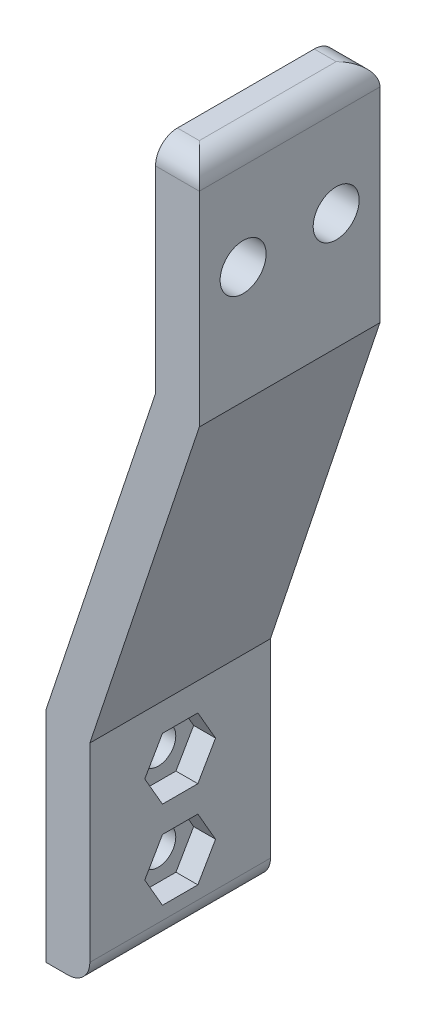
ISO-10303-21;
HEADER;
FILE_DESCRIPTION(('STEP AP214'),'2;1');
FILE_NAME('part.step','',(''),(''),'','','');
FILE_SCHEMA(('AUTOMOTIVE_DESIGN { 1 0 10303 214 1 1 1 1 }'));
ENDSEC;
DATA;
#1=APPLICATION_CONTEXT('core data for automotive mechanical design processes');
#2=APPLICATION_PROTOCOL_DEFINITION('international standard','automotive_design',2000,#1);
#3=PRODUCT_CONTEXT('',#1,'mechanical');
#4=PRODUCT('Part','Part','',(#3));
#5=PRODUCT_RELATED_PRODUCT_CATEGORY('part','',(#4));
#6=PRODUCT_DEFINITION_FORMATION('','',#4);
#7=PRODUCT_DEFINITION_CONTEXT('part definition',#1,'design');
#8=PRODUCT_DEFINITION('design','',#6,#7);
#9=PRODUCT_DEFINITION_SHAPE('','',#8);
#10=(LENGTH_UNIT() NAMED_UNIT(*) SI_UNIT(.MILLI.,.METRE.));
#11=(NAMED_UNIT(*) PLANE_ANGLE_UNIT() SI_UNIT($,.RADIAN.));
#12=(NAMED_UNIT(*) SI_UNIT($,.STERADIAN.) SOLID_ANGLE_UNIT());
#13=UNCERTAINTY_MEASURE_WITH_UNIT(LENGTH_MEASURE(1.E-05),#10,'distance_accuracy_value','');
#14=(GEOMETRIC_REPRESENTATION_CONTEXT(3) GLOBAL_UNCERTAINTY_ASSIGNED_CONTEXT((#13)) GLOBAL_UNIT_ASSIGNED_CONTEXT((#10,
#11,#12)) REPRESENTATION_CONTEXT('',''));
#15=CARTESIAN_POINT('',(0.,0.,0.));
#16=DIRECTION('',(0.,0.,1.));
#17=DIRECTION('',(1.,0.,0.));
#18=AXIS2_PLACEMENT_3D('',#15,#16,#17);
#19=CARTESIAN_POINT('',(-0.001000000000001,6.,8.25));
#20=DIRECTION('',(1.,0.,0.));
#21=DIRECTION('',(0.,1.,0.));
#22=AXIS2_PLACEMENT_3D('',#19,#20,#21);
#23=CYLINDRICAL_SURFACE('',#22,1.6);
#24=CARTESIAN_POINT('',(0.,6.,8.25));
#25=DIRECTION('',(1.,0.,0.));
#26=DIRECTION('',(0.,0.,-1.));
#27=AXIS2_PLACEMENT_3D('',#24,#25,#26);
#28=CIRCLE('',#27,1.6);
#29=CARTESIAN_POINT('',(0.,6.,6.65));
#30=VERTEX_POINT('',#29);
#31=EDGE_CURVE('E292',#30,#30,#28,.F.);
#32=ORIENTED_EDGE('',*,*,#31,.T.);
#33=EDGE_LOOP('',(#32));
#34=FACE_BOUND('',#33,.T.);
#35=CARTESIAN_POINT('',(2.,6.,8.25));
#36=DIRECTION('',(1.,0.,0.));
#37=DIRECTION('',(0.,0.,-1.));
#38=AXIS2_PLACEMENT_3D('',#35,#36,#37);
#39=CIRCLE('',#38,1.6);
#40=CARTESIAN_POINT('',(2.,6.,6.65));
#41=VERTEX_POINT('',#40);
#42=EDGE_CURVE('E37',#41,#41,#39,.F.);
#43=ORIENTED_EDGE('',*,*,#42,.F.);
#44=EDGE_LOOP('',(#43));
#45=FACE_BOUND('',#44,.T.);
#46=ADVANCED_FACE('F33',(#34,#45),#23,.F.);
#47=CARTESIAN_POINT('',(-0.00100000000000187,14.,8.25));
#48=DIRECTION('',(1.,0.,0.));
#49=DIRECTION('',(0.,1.,0.));
#50=AXIS2_PLACEMENT_3D('',#47,#48,#49);
#51=CYLINDRICAL_SURFACE('',#50,1.6);
#52=CARTESIAN_POINT('',(0.,14.,8.25));
#53=DIRECTION('',(1.,0.,0.));
#54=DIRECTION('',(0.,0.,-1.));
#55=AXIS2_PLACEMENT_3D('',#52,#53,#54);
#56=CIRCLE('',#55,1.6);
#57=CARTESIAN_POINT('',(0.,14.,6.65));
#58=VERTEX_POINT('',#57);
#59=EDGE_CURVE('E295',#58,#58,#56,.F.);
#60=ORIENTED_EDGE('',*,*,#59,.T.);
#61=EDGE_LOOP('',(#60));
#62=FACE_BOUND('',#61,.T.);
#63=CARTESIAN_POINT('',(2.,14.,8.25));
#64=DIRECTION('',(1.,0.,0.));
#65=DIRECTION('',(0.,0.,-1.));
#66=AXIS2_PLACEMENT_3D('',#63,#64,#65);
#67=CIRCLE('',#66,1.6);
#68=CARTESIAN_POINT('',(2.,14.,6.65));
#69=VERTEX_POINT('',#68);
#70=EDGE_CURVE('E282',#69,#69,#67,.F.);
#71=ORIENTED_EDGE('',*,*,#70,.F.);
#72=EDGE_LOOP('',(#71));
#73=FACE_BOUND('',#72,.T.);
#74=ADVANCED_FACE('F393',(#62,#73),#51,.F.);
#75=CARTESIAN_POINT('',(4.,0.,16.5));
#76=DIRECTION('',(0.,1.,0.));
#77=DIRECTION('',(-1.,0.,0.));
#78=AXIS2_PLACEMENT_3D('',#75,#76,#77);
#79=PLANE('',#78);
#80=DIRECTION('',(1.,0.,0.));
#81=VECTOR('',#80,1.);
#82=CARTESIAN_POINT('',(4.,0.,0.));
#83=LINE('',#82,#81);
#84=CARTESIAN_POINT('',(0.,0.,0.));
#85=VERTEX_POINT('',#84);
#86=CARTESIAN_POINT('',(2.,0.,0.));
#87=VERTEX_POINT('',#86);
#88=EDGE_CURVE('E324',#85,#87,#83,.T.);
#89=ORIENTED_EDGE('',*,*,#88,.T.);
#90=DIRECTION('',(0.,0.,-1.));
#91=VECTOR('',#90,1.);
#92=CARTESIAN_POINT('',(2.,0.,16.5));
#93=LINE('',#92,#91);
#94=CARTESIAN_POINT('',(2.,0.,16.5));
#95=VERTEX_POINT('',#94);
#96=EDGE_CURVE('E373',#87,#95,#93,.F.);
#97=ORIENTED_EDGE('',*,*,#96,.T.);
#98=DIRECTION('',(1.,0.,0.));
#99=VECTOR('',#98,1.);
#100=CARTESIAN_POINT('',(4.,0.,16.5));
#101=LINE('',#100,#99);
#102=CARTESIAN_POINT('',(0.,0.,16.5));
#103=VERTEX_POINT('',#102);
#104=EDGE_CURVE('E306',#103,#95,#101,.T.);
#105=ORIENTED_EDGE('',*,*,#104,.F.);
#106=DIRECTION('',(0.,0.,-1.));
#107=VECTOR('',#106,1.);
#108=CARTESIAN_POINT('',(0.,0.,16.5));
#109=LINE('',#108,#107);
#110=EDGE_CURVE('E323',#103,#85,#109,.T.);
#111=ORIENTED_EDGE('',*,*,#110,.T.);
#112=EDGE_LOOP('',(#89,#97,#105,#111));
#113=FACE_BOUND('',#112,.T.);
#114=ADVANCED_FACE('F395',(#113),#79,.F.);
#115=CARTESIAN_POINT('',(4.,19.3508893593265,16.5));
#116=DIRECTION('',(-1.,0.,0.));
#117=DIRECTION('',(0.,-1.,0.));
#118=AXIS2_PLACEMENT_3D('',#115,#116,#117);
#119=PLANE('',#118);
#120=DIRECTION('',(0.,0.,1.));
#121=VECTOR('',#120,1.);
#122=CARTESIAN_POINT('',(4.,8.8,6.63341924626905));
#123=LINE('',#122,#121);
#124=CARTESIAN_POINT('',(4.,8.8,6.63341924626905));
#125=VERTEX_POINT('',#124);
#126=CARTESIAN_POINT('',(4.,8.8,9.86658075373095));
#127=VERTEX_POINT('',#126);
#128=EDGE_CURVE('E226',#125,#127,#123,.T.);
#129=ORIENTED_EDGE('',*,*,#128,.F.);
#130=DIRECTION('',(0.,0.866025403784439,0.5));
#131=VECTOR('',#130,1.);
#132=CARTESIAN_POINT('',(4.,6.,5.0168384925381));
#133=LINE('',#132,#131);
#134=CARTESIAN_POINT('',(4.,6.,5.0168384925381));
#135=VERTEX_POINT('',#134);
#136=EDGE_CURVE('E50',#135,#125,#133,.T.);
#137=ORIENTED_EDGE('',*,*,#136,.F.);
#138=DIRECTION('',(0.,0.866025403784439,-0.5));
#139=VECTOR('',#138,1.);
#140=CARTESIAN_POINT('',(4.,3.2,6.63341924626905));
#141=LINE('',#140,#139);
#142=CARTESIAN_POINT('',(4.,3.2,6.63341924626905));
#143=VERTEX_POINT('',#142);
#144=EDGE_CURVE('E212',#143,#135,#141,.T.);
#145=ORIENTED_EDGE('',*,*,#144,.F.);
#146=DIRECTION('',(0.,0.,-1.));
#147=VECTOR('',#146,1.);
#148=CARTESIAN_POINT('',(4.,3.2,9.86658075373095));
#149=LINE('',#148,#147);
#150=CARTESIAN_POINT('',(4.,3.2,9.86658075373095));
#151=VERTEX_POINT('',#150);
#152=EDGE_CURVE('E215',#151,#143,#149,.T.);
#153=ORIENTED_EDGE('',*,*,#152,.F.);
#154=DIRECTION('',(0.,-0.866025403784439,-0.5));
#155=VECTOR('',#154,1.);
#156=CARTESIAN_POINT('',(4.,6.,11.4831615074619));
#157=LINE('',#156,#155);
#158=CARTESIAN_POINT('',(4.,6.,11.4831615074619));
#159=VERTEX_POINT('',#158);
#160=EDGE_CURVE('E231',#159,#151,#157,.T.);
#161=ORIENTED_EDGE('',*,*,#160,.F.);
#162=DIRECTION('',(0.,-0.866025403784438,0.5));
#163=VECTOR('',#162,1.);
#164=CARTESIAN_POINT('',(4.,8.8,9.86658075373095));
#165=LINE('',#164,#163);
#166=EDGE_CURVE('E228',#127,#159,#165,.T.);
#167=ORIENTED_EDGE('',*,*,#166,.F.);
#168=EDGE_LOOP('',(#129,#137,#145,#153,#161,#167));
#169=FACE_BOUND('',#168,.T.);
#170=DIRECTION('',(0.,0.866025403784439,0.5));
#171=VECTOR('',#170,1.);
#172=CARTESIAN_POINT('',(4.,14.,5.0168384925381));
#173=LINE('',#172,#171);
#174=CARTESIAN_POINT('',(4.,14.,5.0168384925381));
#175=VERTEX_POINT('',#174);
#176=CARTESIAN_POINT('',(4.,16.8,6.63341924626905));
#177=VERTEX_POINT('',#176);
#178=EDGE_CURVE('E266',#175,#177,#173,.T.);
#179=ORIENTED_EDGE('',*,*,#178,.F.);
#180=DIRECTION('',(0.,0.866025403784439,-0.5));
#181=VECTOR('',#180,1.);
#182=CARTESIAN_POINT('',(4.,11.2,6.63341924626905));
#183=LINE('',#182,#181);
#184=CARTESIAN_POINT('',(4.,11.2,6.63341924626905));
#185=VERTEX_POINT('',#184);
#186=EDGE_CURVE('E58',#185,#175,#183,.T.);
#187=ORIENTED_EDGE('',*,*,#186,.F.);
#188=DIRECTION('',(0.,0.,-1.));
#189=VECTOR('',#188,1.);
#190=CARTESIAN_POINT('',(4.,11.2,9.86658075373095));
#191=LINE('',#190,#189);
#192=CARTESIAN_POINT('',(4.,11.2,9.86658075373095));
#193=VERTEX_POINT('',#192);
#194=EDGE_CURVE('E249',#193,#185,#191,.T.);
#195=ORIENTED_EDGE('',*,*,#194,.F.);
#196=DIRECTION('',(0.,-0.866025403784439,-0.5));
#197=VECTOR('',#196,1.);
#198=CARTESIAN_POINT('',(4.,14.,11.4831615074619));
#199=LINE('',#198,#197);
#200=CARTESIAN_POINT('',(4.,14.,11.4831615074619));
#201=VERTEX_POINT('',#200);
#202=EDGE_CURVE('E275',#201,#193,#199,.T.);
#203=ORIENTED_EDGE('',*,*,#202,.F.);
#204=DIRECTION('',(0.,-0.866025403784439,0.5));
#205=VECTOR('',#204,1.);
#206=CARTESIAN_POINT('',(4.,16.8,9.86658075373096));
#207=LINE('',#206,#205);
#208=CARTESIAN_POINT('',(4.,16.8,9.86658075373096));
#209=VERTEX_POINT('',#208);
#210=EDGE_CURVE('E272',#209,#201,#207,.T.);
#211=ORIENTED_EDGE('',*,*,#210,.F.);
#212=DIRECTION('',(0.,0.,1.));
#213=VECTOR('',#212,1.);
#214=CARTESIAN_POINT('',(4.,16.8,6.63341924626905));
#215=LINE('',#214,#213);
#216=EDGE_CURVE('E269',#177,#209,#215,.T.);
#217=ORIENTED_EDGE('',*,*,#216,.F.);
#218=EDGE_LOOP('',(#179,#187,#195,#203,#211,#217));
#219=FACE_BOUND('',#218,.T.);
#220=DIRECTION('',(0.,1.,0.));
#221=VECTOR('',#220,1.);
#222=CARTESIAN_POINT('',(4.,19.3508893593265,16.5));
#223=LINE('',#222,#221);
#224=CARTESIAN_POINT('',(4.,2.,16.5));
#225=VERTEX_POINT('',#224);
#226=CARTESIAN_POINT('',(4.,19.3508893593265,16.5));
#227=VERTEX_POINT('',#226);
#228=EDGE_CURVE('E309',#225,#227,#223,.T.);
#229=ORIENTED_EDGE('',*,*,#228,.F.);
#230=DIRECTION('',(0.,0.,-1.));
#231=VECTOR('',#230,1.);
#232=CARTESIAN_POINT('',(4.,2.,16.5));
#233=LINE('',#232,#231);
#234=CARTESIAN_POINT('',(4.,2.,0.));
#235=VERTEX_POINT('',#234);
#236=EDGE_CURVE('E370',#225,#235,#233,.T.);
#237=ORIENTED_EDGE('',*,*,#236,.T.);
#238=DIRECTION('',(0.,1.,0.));
#239=VECTOR('',#238,1.);
#240=CARTESIAN_POINT('',(4.,19.3508893593265,0.));
#241=LINE('',#240,#239);
#242=CARTESIAN_POINT('',(4.,19.3508893593265,0.));
#243=VERTEX_POINT('',#242);
#244=EDGE_CURVE('E327',#235,#243,#241,.T.);
#245=ORIENTED_EDGE('',*,*,#244,.T.);
#246=DIRECTION('',(0.,0.,-1.));
#247=VECTOR('',#246,1.);
#248=CARTESIAN_POINT('',(4.,19.3508893593265,16.5));
#249=LINE('',#248,#247);
#250=EDGE_CURVE('E353',#227,#243,#249,.T.);
#251=ORIENTED_EDGE('',*,*,#250,.F.);
#252=EDGE_LOOP('',(#229,#237,#245,#251));
#253=FACE_BOUND('',#252,.T.);
#254=ADVANCED_FACE('F402',(#169,#219,#253),#119,.F.);
#255=CARTESIAN_POINT('',(14.0000000000001,49.3508893593269,16.5));
#256=DIRECTION('',(-0.948683298050514,0.316227766016838,0.));
#257=DIRECTION('',(-0.316227766016838,-0.948683298050514,0.));
#258=AXIS2_PLACEMENT_3D('',#255,#256,#257);
#259=PLANE('',#258);
#260=DIRECTION('',(0.316227766016838,0.948683298050514,0.));
#261=VECTOR('',#260,1.);
#262=CARTESIAN_POINT('',(14.0000000000001,49.3508893593269,0.));
#263=LINE('',#262,#261);
#264=CARTESIAN_POINT('',(14.0000000000001,49.3508893593269,0.));
#265=VERTEX_POINT('',#264);
#266=EDGE_CURVE('E329',#243,#265,#263,.T.);
#267=ORIENTED_EDGE('',*,*,#266,.T.);
#268=DIRECTION('',(0.,0.,-1.));
#269=VECTOR('',#268,1.);
#270=CARTESIAN_POINT('',(14.0000000000001,49.3508893593269,16.5));
#271=LINE('',#270,#269);
#272=CARTESIAN_POINT('',(14.0000000000001,49.3508893593269,16.5));
#273=VERTEX_POINT('',#272);
#274=EDGE_CURVE('E350',#273,#265,#271,.T.);
#275=ORIENTED_EDGE('',*,*,#274,.F.);
#276=DIRECTION('',(0.316227766016838,0.948683298050514,0.));
#277=VECTOR('',#276,1.);
#278=CARTESIAN_POINT('',(14.0000000000001,49.3508893593269,16.5));
#279=LINE('',#278,#277);
#280=EDGE_CURVE('E312',#227,#273,#279,.T.);
#281=ORIENTED_EDGE('',*,*,#280,.F.);
#282=ORIENTED_EDGE('',*,*,#250,.T.);
#283=EDGE_LOOP('',(#267,#275,#281,#282));
#284=FACE_BOUND('',#283,.T.);
#285=ADVANCED_FACE('F445',(#284),#259,.F.);
#286=CARTESIAN_POINT('',(14.0000000000001,70.,16.5));
#287=DIRECTION('',(-1.,0.,0.));
#288=DIRECTION('',(0.,-1.,0.));
#289=AXIS2_PLACEMENT_3D('',#286,#287,#288);
#290=PLANE('',#289);
#291=CARTESIAN_POINT('',(14.0000000000001,60.,4.));
#292=DIRECTION('',(1.,0.,0.));
#293=DIRECTION('',(0.,1.,0.));
#294=AXIS2_PLACEMENT_3D('',#291,#292,#293);
#295=CIRCLE('',#294,2.1);
#296=CARTESIAN_POINT('',(14.0000000000001,62.1,4.));
#297=VERTEX_POINT('',#296);
#298=EDGE_CURVE('E298',#297,#297,#295,.T.);
#299=ORIENTED_EDGE('',*,*,#298,.F.);
#300=EDGE_LOOP('',(#299));
#301=FACE_BOUND('',#300,.T.);
#302=CARTESIAN_POINT('',(14.0000000000001,60.,12.5));
#303=DIRECTION('',(1.,0.,0.));
#304=DIRECTION('',(0.,1.,0.));
#305=AXIS2_PLACEMENT_3D('',#302,#303,#304);
#306=CIRCLE('',#305,2.1);
#307=CARTESIAN_POINT('',(14.0000000000001,62.1,12.5));
#308=VERTEX_POINT('',#307);
#309=EDGE_CURVE('E302',#308,#308,#306,.T.);
#310=ORIENTED_EDGE('',*,*,#309,.F.);
#311=EDGE_LOOP('',(#310));
#312=FACE_BOUND('',#311,.T.);
#313=DIRECTION('',(0.,1.,0.));
#314=VECTOR('',#313,1.);
#315=CARTESIAN_POINT('',(14.0000000000001,70.,0.));
#316=LINE('',#315,#314);
#317=CARTESIAN_POINT('',(14.0000000000001,68.,0.));
#318=VERTEX_POINT('',#317);
#319=EDGE_CURVE('E331',#265,#318,#316,.T.);
#320=ORIENTED_EDGE('',*,*,#319,.T.);
#321=DIRECTION('',(0.,0.,-1.));
#322=VECTOR('',#321,1.);
#323=CARTESIAN_POINT('',(14.0000000000001,68.,16.5));
#324=LINE('',#323,#322);
#325=CARTESIAN_POINT('',(14.0000000000001,68.,16.5));
#326=VERTEX_POINT('',#325);
#327=EDGE_CURVE('E365',#318,#326,#324,.F.);
#328=ORIENTED_EDGE('',*,*,#327,.T.);
#329=DIRECTION('',(0.,1.,0.));
#330=VECTOR('',#329,1.);
#331=CARTESIAN_POINT('',(14.0000000000001,70.,16.5));
#332=LINE('',#331,#330);
#333=EDGE_CURVE('E314',#273,#326,#332,.T.);
#334=ORIENTED_EDGE('',*,*,#333,.F.);
#335=ORIENTED_EDGE('',*,*,#274,.T.);
#336=EDGE_LOOP('',(#320,#328,#334,#335));
#337=FACE_BOUND('',#336,.T.);
#338=ADVANCED_FACE('F441',(#301,#312,#337),#290,.F.);
#339=CARTESIAN_POINT('',(10.,70.,16.5));
#340=DIRECTION('',(0.,-1.,0.));
#341=DIRECTION('',(0.,0.,-1.));
#342=AXIS2_PLACEMENT_3D('',#339,#340,#341);
#343=PLANE('',#342);
#344=DIRECTION('',(0.,0.,-1.));
#345=VECTOR('',#344,1.);
#346=CARTESIAN_POINT('',(12.0000000000001,70.,16.5));
#347=LINE('',#346,#345);
#348=CARTESIAN_POINT('',(12.0000000000001,70.,14.5));
#349=VERTEX_POINT('',#348);
#350=CARTESIAN_POINT('',(12.0000000000001,70.,2.));
#351=VERTEX_POINT('',#350);
#352=EDGE_CURVE('E356',#349,#351,#347,.T.);
#353=ORIENTED_EDGE('',*,*,#352,.T.);
#354=DIRECTION('',(-1.,0.,0.));
#355=VECTOR('',#354,1.);
#356=CARTESIAN_POINT('',(10.,70.,2.));
#357=LINE('',#356,#355);
#358=CARTESIAN_POINT('',(10.,70.,2.));
#359=VERTEX_POINT('',#358);
#360=EDGE_CURVE('E377',#351,#359,#357,.T.);
#361=ORIENTED_EDGE('',*,*,#360,.T.);
#362=DIRECTION('',(0.,0.,-1.));
#363=VECTOR('',#362,1.);
#364=CARTESIAN_POINT('',(10.,70.,16.5));
#365=LINE('',#364,#363);
#366=CARTESIAN_POINT('',(10.,70.,14.5));
#367=VERTEX_POINT('',#366);
#368=EDGE_CURVE('E347',#367,#359,#365,.T.);
#369=ORIENTED_EDGE('',*,*,#368,.F.);
#370=DIRECTION('',(-1.,0.,0.));
#371=VECTOR('',#370,1.);
#372=CARTESIAN_POINT('',(10.,70.,14.5));
#373=LINE('',#372,#371);
#374=EDGE_CURVE('E375',#367,#349,#373,.F.);
#375=ORIENTED_EDGE('',*,*,#374,.T.);
#376=EDGE_LOOP('',(#353,#361,#369,#375));
#377=FACE_BOUND('',#376,.T.);
#378=ADVANCED_FACE('F437',(#377),#343,.F.);
#379=CARTESIAN_POINT('',(10.,50.,16.5));
#380=DIRECTION('',(1.,0.,0.));
#381=DIRECTION('',(0.,0.,-1.));
#382=AXIS2_PLACEMENT_3D('',#379,#380,#381);
#383=PLANE('',#382);
#384=CARTESIAN_POINT('',(10.,60.,4.));
#385=DIRECTION('',(1.,0.,0.));
#386=DIRECTION('',(0.,0.,-1.));
#387=AXIS2_PLACEMENT_3D('',#384,#385,#386);
#388=CIRCLE('',#387,2.1);
#389=CARTESIAN_POINT('',(10.,60.,1.9));
#390=VERTEX_POINT('',#389);
#391=EDGE_CURVE('E301',#390,#390,#388,.T.);
#392=ORIENTED_EDGE('',*,*,#391,.T.);
#393=EDGE_LOOP('',(#392));
#394=FACE_BOUND('',#393,.T.);
#395=CARTESIAN_POINT('',(10.,60.,12.5));
#396=DIRECTION('',(1.,0.,0.));
#397=DIRECTION('',(0.,0.,-1.));
#398=AXIS2_PLACEMENT_3D('',#395,#396,#397);
#399=CIRCLE('',#398,2.1);
#400=CARTESIAN_POINT('',(10.,60.,10.4));
#401=VERTEX_POINT('',#400);
#402=EDGE_CURVE('E305',#401,#401,#399,.T.);
#403=ORIENTED_EDGE('',*,*,#402,.T.);
#404=EDGE_LOOP('',(#403));
#405=FACE_BOUND('',#404,.T.);
#406=ORIENTED_EDGE('',*,*,#368,.T.);
#407=CARTESIAN_POINT('',(10.,68.,2.));
#408=DIRECTION('',(1.,0.,0.));
#409=DIRECTION('',(0.,0.,-1.));
#410=AXIS2_PLACEMENT_3D('',#407,#408,#409);
#411=CIRCLE('',#410,2.);
#412=CARTESIAN_POINT('',(10.,68.,0.));
#413=VERTEX_POINT('',#412);
#414=EDGE_CURVE('E382',#359,#413,#411,.F.);
#415=ORIENTED_EDGE('',*,*,#414,.T.);
#416=DIRECTION('',(0.,-1.,0.));
#417=VECTOR('',#416,1.);
#418=CARTESIAN_POINT('',(10.,50.,0.));
#419=LINE('',#418,#417);
#420=CARTESIAN_POINT('',(10.,50.,0.));
#421=VERTEX_POINT('',#420);
#422=EDGE_CURVE('E334',#413,#421,#419,.T.);
#423=ORIENTED_EDGE('',*,*,#422,.T.);
#424=DIRECTION('',(0.,0.,-1.));
#425=VECTOR('',#424,1.);
#426=CARTESIAN_POINT('',(10.,50.,16.5));
#427=LINE('',#426,#425);
#428=CARTESIAN_POINT('',(10.,50.,16.5));
#429=VERTEX_POINT('',#428);
#430=EDGE_CURVE('E344',#429,#421,#427,.T.);
#431=ORIENTED_EDGE('',*,*,#430,.F.);
#432=DIRECTION('',(0.,-1.,0.));
#433=VECTOR('',#432,1.);
#434=CARTESIAN_POINT('',(10.,50.,16.5));
#435=LINE('',#434,#433);
#436=CARTESIAN_POINT('',(10.,68.,16.5));
#437=VERTEX_POINT('',#436);
#438=EDGE_CURVE('E317',#437,#429,#435,.T.);
#439=ORIENTED_EDGE('',*,*,#438,.F.);
#440=CARTESIAN_POINT('',(10.,68.,14.5));
#441=DIRECTION('',(1.,0.,0.));
#442=DIRECTION('',(0.,0.,-1.));
#443=AXIS2_PLACEMENT_3D('',#440,#441,#442);
#444=CIRCLE('',#443,2.);
#445=EDGE_CURVE('E380',#437,#367,#444,.F.);
#446=ORIENTED_EDGE('',*,*,#445,.T.);
#447=EDGE_LOOP('',(#406,#415,#423,#431,#439,#446));
#448=FACE_BOUND('',#447,.T.);
#449=ADVANCED_FACE('F433',(#394,#405,#448),#383,.F.);
#450=CARTESIAN_POINT('',(0.,20.,16.5));
#451=DIRECTION('',(0.948683298050514,-0.316227766016838,0.));
#452=DIRECTION('',(0.316227766016838,0.948683298050514,0.));
#453=AXIS2_PLACEMENT_3D('',#450,#451,#452);
#454=PLANE('',#453);
#455=DIRECTION('',(-0.316227766016838,-0.948683298050514,0.));
#456=VECTOR('',#455,1.);
#457=CARTESIAN_POINT('',(0.,20.,0.));
#458=LINE('',#457,#456);
#459=CARTESIAN_POINT('',(0.,20.,0.));
#460=VERTEX_POINT('',#459);
#461=EDGE_CURVE('E336',#421,#460,#458,.T.);
#462=ORIENTED_EDGE('',*,*,#461,.T.);
#463=DIRECTION('',(0.,0.,-1.));
#464=VECTOR('',#463,1.);
#465=CARTESIAN_POINT('',(0.,20.,16.5));
#466=LINE('',#465,#464);
#467=CARTESIAN_POINT('',(0.,20.,16.5));
#468=VERTEX_POINT('',#467);
#469=EDGE_CURVE('E341',#468,#460,#466,.T.);
#470=ORIENTED_EDGE('',*,*,#469,.F.);
#471=DIRECTION('',(-0.316227766016838,-0.948683298050514,0.));
#472=VECTOR('',#471,1.);
#473=CARTESIAN_POINT('',(0.,20.,16.5));
#474=LINE('',#473,#472);
#475=EDGE_CURVE('E319',#429,#468,#474,.T.);
#476=ORIENTED_EDGE('',*,*,#475,.F.);
#477=ORIENTED_EDGE('',*,*,#430,.T.);
#478=EDGE_LOOP('',(#462,#470,#476,#477));
#479=FACE_BOUND('',#478,.T.);
#480=ADVANCED_FACE('F429',(#479),#454,.F.);
#481=CARTESIAN_POINT('',(0.,0.,16.5));
#482=DIRECTION('',(1.,0.,0.));
#483=DIRECTION('',(0.,0.,-1.));
#484=AXIS2_PLACEMENT_3D('',#481,#482,#483);
#485=PLANE('',#484);
#486=ORIENTED_EDGE('',*,*,#31,.F.);
#487=EDGE_LOOP('',(#486));
#488=FACE_BOUND('',#487,.T.);
#489=ORIENTED_EDGE('',*,*,#59,.F.);
#490=EDGE_LOOP('',(#489));
#491=FACE_BOUND('',#490,.T.);
#492=DIRECTION('',(0.,-1.,0.));
#493=VECTOR('',#492,1.);
#494=CARTESIAN_POINT('',(0.,0.,0.));
#495=LINE('',#494,#493);
#496=EDGE_CURVE('E310',#460,#85,#495,.T.);
#497=ORIENTED_EDGE('',*,*,#496,.T.);
#498=ORIENTED_EDGE('',*,*,#110,.F.);
#499=DIRECTION('',(0.,-1.,0.));
#500=VECTOR('',#499,1.);
#501=CARTESIAN_POINT('',(0.,0.,16.5));
#502=LINE('',#501,#500);
#503=EDGE_CURVE('E321',#468,#103,#502,.T.);
#504=ORIENTED_EDGE('',*,*,#503,.F.);
#505=ORIENTED_EDGE('',*,*,#469,.T.);
#506=EDGE_LOOP('',(#497,#498,#504,#505));
#507=FACE_BOUND('',#506,.T.);
#508=ADVANCED_FACE('F422',(#488,#491,#507),#485,.F.);
#509=CARTESIAN_POINT('',(0.,0.,16.5));
#510=DIRECTION('',(0.,0.,-1.));
#511=DIRECTION('',(-1.,0.,0.));
#512=AXIS2_PLACEMENT_3D('',#509,#510,#511);
#513=PLANE('',#512);
#514=ORIENTED_EDGE('',*,*,#333,.T.);
#515=DIRECTION('',(-1.,0.,0.));
#516=VECTOR('',#515,1.);
#517=CARTESIAN_POINT('',(0.,68.,16.5));
#518=LINE('',#517,#516);
#519=EDGE_CURVE('E11',#326,#437,#518,.T.);
#520=ORIENTED_EDGE('',*,*,#519,.T.);
#521=ORIENTED_EDGE('',*,*,#438,.T.);
#522=ORIENTED_EDGE('',*,*,#475,.T.);
#523=ORIENTED_EDGE('',*,*,#503,.T.);
#524=ORIENTED_EDGE('',*,*,#104,.T.);
#525=CARTESIAN_POINT('',(2.,2.,16.5));
#526=DIRECTION('',(0.,0.,-1.));
#527=DIRECTION('',(-1.,0.,0.));
#528=AXIS2_PLACEMENT_3D('',#525,#526,#527);
#529=CIRCLE('',#528,2.);
#530=EDGE_CURVE('E368',#95,#225,#529,.F.);
#531=ORIENTED_EDGE('',*,*,#530,.T.);
#532=ORIENTED_EDGE('',*,*,#228,.T.);
#533=ORIENTED_EDGE('',*,*,#280,.T.);
#534=EDGE_LOOP('',(#514,#520,#521,#522,#523,#524,#531,#532,#533));
#535=FACE_BOUND('',#534,.T.);
#536=ADVANCED_FACE('F419',(#535),#513,.F.);
#537=CARTESIAN_POINT('',(0.,0.,0.));
#538=DIRECTION('',(0.,0.,-1.));
#539=DIRECTION('',(-1.,0.,0.));
#540=AXIS2_PLACEMENT_3D('',#537,#538,#539);
#541=PLANE('',#540);
#542=ORIENTED_EDGE('',*,*,#422,.F.);
#543=DIRECTION('',(-1.,0.,0.));
#544=VECTOR('',#543,1.);
#545=CARTESIAN_POINT('',(12.0000000000001,68.,0.));
#546=LINE('',#545,#544);
#547=EDGE_CURVE('E384',#413,#318,#546,.F.);
#548=ORIENTED_EDGE('',*,*,#547,.T.);
#549=ORIENTED_EDGE('',*,*,#319,.F.);
#550=ORIENTED_EDGE('',*,*,#266,.F.);
#551=ORIENTED_EDGE('',*,*,#244,.F.);
#552=CARTESIAN_POINT('',(2.,2.,0.));
#553=DIRECTION('',(0.,0.,-1.));
#554=DIRECTION('',(-1.,0.,0.));
#555=AXIS2_PLACEMENT_3D('',#552,#553,#554);
#556=CIRCLE('',#555,2.);
#557=EDGE_CURVE('E363',#235,#87,#556,.T.);
#558=ORIENTED_EDGE('',*,*,#557,.T.);
#559=ORIENTED_EDGE('',*,*,#88,.F.);
#560=ORIENTED_EDGE('',*,*,#496,.F.);
#561=ORIENTED_EDGE('',*,*,#461,.F.);
#562=EDGE_LOOP('',(#542,#548,#549,#550,#551,#558,#559,#560,#561));
#563=FACE_BOUND('',#562,.T.);
#564=ADVANCED_FACE('F417',(#563),#541,.T.);
#565=CARTESIAN_POINT('',(-2.49999999999986,60.,12.5));
#566=DIRECTION('',(1.,0.,0.));
#567=DIRECTION('',(0.,1.,0.));
#568=AXIS2_PLACEMENT_3D('',#565,#566,#567);
#569=CYLINDRICAL_SURFACE('',#568,2.1);
#570=ORIENTED_EDGE('',*,*,#309,.T.);
#571=EDGE_LOOP('',(#570));
#572=FACE_BOUND('',#571,.T.);
#573=ORIENTED_EDGE('',*,*,#402,.F.);
#574=EDGE_LOOP('',(#573));
#575=FACE_BOUND('',#574,.T.);
#576=ADVANCED_FACE('F413',(#572,#575),#569,.F.);
#577=CARTESIAN_POINT('',(-2.49999999999986,60.,4.));
#578=DIRECTION('',(1.,0.,0.));
#579=DIRECTION('',(0.,1.,0.));
#580=AXIS2_PLACEMENT_3D('',#577,#578,#579);
#581=CYLINDRICAL_SURFACE('',#580,2.1);
#582=ORIENTED_EDGE('',*,*,#298,.T.);
#583=EDGE_LOOP('',(#582));
#584=FACE_BOUND('',#583,.T.);
#585=ORIENTED_EDGE('',*,*,#391,.F.);
#586=EDGE_LOOP('',(#585));
#587=FACE_BOUND('',#586,.T.);
#588=ADVANCED_FACE('F409',(#584,#587),#581,.F.);
#589=CARTESIAN_POINT('',(12.0000000000001,68.,16.5));
#590=DIRECTION('',(0.,0.,-1.));
#591=DIRECTION('',(-1.,0.,0.));
#592=AXIS2_PLACEMENT_3D('',#589,#590,#591);
#593=CYLINDRICAL_SURFACE('',#592,2.);
#594=ORIENTED_EDGE('',*,*,#327,.F.);
#595=CARTESIAN_POINT('',(12.0000000000001,68.,2.));
#596=DIRECTION('',(-0.707106781186547,0.,-0.707106781186547));
#597=DIRECTION('',(0.707106781186547,0.,-0.707106781186547));
#598=AXIS2_PLACEMENT_3D('',#595,#596,#597);
#599=ELLIPSE('',#598,2.82842712474619,2.);
#600=EDGE_CURVE('E42',#318,#351,#599,.F.);
#601=ORIENTED_EDGE('',*,*,#600,.T.);
#602=ORIENTED_EDGE('',*,*,#352,.F.);
#603=CARTESIAN_POINT('',(12.0000000000001,68.,14.5));
#604=DIRECTION('',(0.707106781186547,0.,-0.707106781186547));
#605=DIRECTION('',(-0.707106781186547,0.,-0.707106781186547));
#606=AXIS2_PLACEMENT_3D('',#603,#604,#605);
#607=ELLIPSE('',#606,2.82842712474619,2.);
#608=EDGE_CURVE('E386',#349,#326,#607,.T.);
#609=ORIENTED_EDGE('',*,*,#608,.T.);
#610=EDGE_LOOP('',(#594,#601,#602,#609));
#611=FACE_BOUND('',#610,.T.);
#612=ADVANCED_FACE('F412',(#611),#593,.T.);
#613=CARTESIAN_POINT('',(2.,2.,16.5));
#614=DIRECTION('',(0.,0.,-1.));
#615=DIRECTION('',(-1.,0.,0.));
#616=AXIS2_PLACEMENT_3D('',#613,#614,#615);
#617=CYLINDRICAL_SURFACE('',#616,2.);
#618=ORIENTED_EDGE('',*,*,#530,.F.);
#619=ORIENTED_EDGE('',*,*,#96,.F.);
#620=ORIENTED_EDGE('',*,*,#557,.F.);
#621=ORIENTED_EDGE('',*,*,#236,.F.);
#622=EDGE_LOOP('',(#618,#619,#620,#621));
#623=FACE_BOUND('',#622,.T.);
#624=ADVANCED_FACE('F455',(#623),#617,.T.);
#625=CARTESIAN_POINT('',(10.,68.,2.));
#626=DIRECTION('',(1.,0.,0.));
#627=DIRECTION('',(0.,0.,-1.));
#628=AXIS2_PLACEMENT_3D('',#625,#626,#627);
#629=CYLINDRICAL_SURFACE('',#628,2.);
#630=ORIENTED_EDGE('',*,*,#600,.F.);
#631=ORIENTED_EDGE('',*,*,#547,.F.);
#632=ORIENTED_EDGE('',*,*,#414,.F.);
#633=ORIENTED_EDGE('',*,*,#360,.F.);
#634=EDGE_LOOP('',(#630,#631,#632,#633));
#635=FACE_BOUND('',#634,.T.);
#636=ADVANCED_FACE('F458',(#635),#629,.T.);
#637=CARTESIAN_POINT('',(0.,68.,14.5));
#638=DIRECTION('',(-1.,0.,0.));
#639=DIRECTION('',(0.,0.,1.));
#640=AXIS2_PLACEMENT_3D('',#637,#638,#639);
#641=CYLINDRICAL_SURFACE('',#640,2.);
#642=ORIENTED_EDGE('',*,*,#608,.F.);
#643=ORIENTED_EDGE('',*,*,#374,.F.);
#644=ORIENTED_EDGE('',*,*,#445,.F.);
#645=ORIENTED_EDGE('',*,*,#519,.F.);
#646=EDGE_LOOP('',(#642,#643,#644,#645));
#647=FACE_BOUND('',#646,.T.);
#648=ADVANCED_FACE('F35',(#647),#641,.T.);
#649=CARTESIAN_POINT('',(2.,0.,0.));
#650=DIRECTION('',(1.,0.,0.));
#651=DIRECTION('',(0.,0.,-1.));
#652=AXIS2_PLACEMENT_3D('',#649,#650,#651);
#653=PLANE('',#652);
#654=DIRECTION('',(0.,0.866025403784439,-0.5));
#655=VECTOR('',#654,1.);
#656=CARTESIAN_POINT('',(2.,11.2,6.63341924626905));
#657=LINE('',#656,#655);
#658=CARTESIAN_POINT('',(2.,11.2,6.63341924626905));
#659=VERTEX_POINT('',#658);
#660=CARTESIAN_POINT('',(2.,14.,5.0168384925381));
#661=VERTEX_POINT('',#660);
#662=EDGE_CURVE('E245',#659,#661,#657,.T.);
#663=ORIENTED_EDGE('',*,*,#662,.T.);
#664=DIRECTION('',(0.,0.866025403784439,0.5));
#665=VECTOR('',#664,1.);
#666=CARTESIAN_POINT('',(2.,14.,5.0168384925381));
#667=LINE('',#666,#665);
#668=CARTESIAN_POINT('',(2.,16.8,6.63341924626905));
#669=VERTEX_POINT('',#668);
#670=EDGE_CURVE('E248',#661,#669,#667,.T.);
#671=ORIENTED_EDGE('',*,*,#670,.T.);
#672=DIRECTION('',(0.,0.,1.));
#673=VECTOR('',#672,1.);
#674=CARTESIAN_POINT('',(2.,16.8,6.63341924626905));
#675=LINE('',#674,#673);
#676=CARTESIAN_POINT('',(2.,16.8,9.86658075373096));
#677=VERTEX_POINT('',#676);
#678=EDGE_CURVE('E252',#669,#677,#675,.T.);
#679=ORIENTED_EDGE('',*,*,#678,.T.);
#680=DIRECTION('',(0.,-0.866025403784439,0.5));
#681=VECTOR('',#680,1.);
#682=CARTESIAN_POINT('',(2.,16.8,9.86658075373096));
#683=LINE('',#682,#681);
#684=CARTESIAN_POINT('',(2.,14.,11.4831615074619));
#685=VERTEX_POINT('',#684);
#686=EDGE_CURVE('E255',#677,#685,#683,.T.);
#687=ORIENTED_EDGE('',*,*,#686,.T.);
#688=DIRECTION('',(0.,-0.866025403784439,-0.5));
#689=VECTOR('',#688,1.);
#690=CARTESIAN_POINT('',(2.,14.,11.4831615074619));
#691=LINE('',#690,#689);
#692=CARTESIAN_POINT('',(2.,11.2,9.86658075373095));
#693=VERTEX_POINT('',#692);
#694=EDGE_CURVE('E258',#685,#693,#691,.T.);
#695=ORIENTED_EDGE('',*,*,#694,.T.);
#696=DIRECTION('',(0.,0.,-1.));
#697=VECTOR('',#696,1.);
#698=CARTESIAN_POINT('',(2.,11.2,9.86658075373095));
#699=LINE('',#698,#697);
#700=EDGE_CURVE('E261',#693,#659,#699,.T.);
#701=ORIENTED_EDGE('',*,*,#700,.T.);
#702=EDGE_LOOP('',(#663,#671,#679,#687,#695,#701));
#703=FACE_BOUND('',#702,.T.);
#704=ORIENTED_EDGE('',*,*,#70,.T.);
#705=EDGE_LOOP('',(#704));
#706=FACE_BOUND('',#705,.T.);
#707=ADVANCED_FACE('F391',(#703,#706),#653,.T.);
#708=CARTESIAN_POINT('',(2.,11.2,6.63341924626905));
#709=DIRECTION('',(0.,-0.5,-0.866025403784439));
#710=DIRECTION('',(0.,0.866025403784439,-0.5));
#711=AXIS2_PLACEMENT_3D('',#708,#709,#710);
#712=PLANE('',#711);
#713=ORIENTED_EDGE('',*,*,#186,.T.);
#714=DIRECTION('',(1.,0.,0.));
#715=VECTOR('',#714,1.);
#716=CARTESIAN_POINT('',(2.,14.,5.0168384925381));
#717=LINE('',#716,#715);
#718=EDGE_CURVE('E264',#661,#175,#717,.T.);
#719=ORIENTED_EDGE('',*,*,#718,.F.);
#720=ORIENTED_EDGE('',*,*,#662,.F.);
#721=DIRECTION('',(1.,0.,0.));
#722=VECTOR('',#721,1.);
#723=CARTESIAN_POINT('',(2.,11.2,6.63341924626905));
#724=LINE('',#723,#722);
#725=EDGE_CURVE('E280',#659,#185,#724,.T.);
#726=ORIENTED_EDGE('',*,*,#725,.T.);
#727=EDGE_LOOP('',(#713,#719,#720,#726));
#728=FACE_BOUND('',#727,.T.);
#729=ADVANCED_FACE('F504',(#728),#712,.F.);
#730=CARTESIAN_POINT('',(2.,11.2,9.86658075373095));
#731=DIRECTION('',(0.,-1.,0.));
#732=DIRECTION('',(1.,0.,0.));
#733=AXIS2_PLACEMENT_3D('',#730,#731,#732);
#734=PLANE('',#733);
#735=ORIENTED_EDGE('',*,*,#194,.T.);
#736=ORIENTED_EDGE('',*,*,#725,.F.);
#737=ORIENTED_EDGE('',*,*,#700,.F.);
#738=DIRECTION('',(1.,0.,0.));
#739=VECTOR('',#738,1.);
#740=CARTESIAN_POINT('',(2.,11.2,9.86658075373095));
#741=LINE('',#740,#739);
#742=EDGE_CURVE('E283',#693,#193,#741,.T.);
#743=ORIENTED_EDGE('',*,*,#742,.T.);
#744=EDGE_LOOP('',(#735,#736,#737,#743));
#745=FACE_BOUND('',#744,.T.);
#746=ADVANCED_FACE('F510',(#745),#734,.F.);
#747=CARTESIAN_POINT('',(2.,14.,11.4831615074619));
#748=DIRECTION('',(0.,-0.5,0.866025403784439));
#749=DIRECTION('',(0.,-0.866025403784439,-0.5));
#750=AXIS2_PLACEMENT_3D('',#747,#748,#749);
#751=PLANE('',#750);
#752=ORIENTED_EDGE('',*,*,#202,.T.);
#753=ORIENTED_EDGE('',*,*,#742,.F.);
#754=ORIENTED_EDGE('',*,*,#694,.F.);
#755=DIRECTION('',(1.,0.,0.));
#756=VECTOR('',#755,1.);
#757=CARTESIAN_POINT('',(2.,14.,11.4831615074619));
#758=LINE('',#757,#756);
#759=EDGE_CURVE('E285',#685,#201,#758,.T.);
#760=ORIENTED_EDGE('',*,*,#759,.T.);
#761=EDGE_LOOP('',(#752,#753,#754,#760));
#762=FACE_BOUND('',#761,.T.);
#763=ADVANCED_FACE('F516',(#762),#751,.F.);
#764=CARTESIAN_POINT('',(2.,16.8,9.86658075373096));
#765=DIRECTION('',(0.,0.5,0.866025403784439));
#766=DIRECTION('',(0.,-0.866025403784439,0.5));
#767=AXIS2_PLACEMENT_3D('',#764,#765,#766);
#768=PLANE('',#767);
#769=ORIENTED_EDGE('',*,*,#210,.T.);
#770=ORIENTED_EDGE('',*,*,#759,.F.);
#771=ORIENTED_EDGE('',*,*,#686,.F.);
#772=DIRECTION('',(1.,0.,0.));
#773=VECTOR('',#772,1.);
#774=CARTESIAN_POINT('',(2.,16.8,9.86658075373096));
#775=LINE('',#774,#773);
#776=EDGE_CURVE('E287',#677,#209,#775,.T.);
#777=ORIENTED_EDGE('',*,*,#776,.T.);
#778=EDGE_LOOP('',(#769,#770,#771,#777));
#779=FACE_BOUND('',#778,.T.);
#780=ADVANCED_FACE('F520',(#779),#768,.F.);
#781=CARTESIAN_POINT('',(2.,16.8,6.63341924626905));
#782=DIRECTION('',(0.,1.,0.));
#783=DIRECTION('',(-1.,0.,0.));
#784=AXIS2_PLACEMENT_3D('',#781,#782,#783);
#785=PLANE('',#784);
#786=ORIENTED_EDGE('',*,*,#216,.T.);
#787=ORIENTED_EDGE('',*,*,#776,.F.);
#788=ORIENTED_EDGE('',*,*,#678,.F.);
#789=DIRECTION('',(1.,0.,0.));
#790=VECTOR('',#789,1.);
#791=CARTESIAN_POINT('',(2.,16.8,6.63341924626905));
#792=LINE('',#791,#790);
#793=EDGE_CURVE('E289',#669,#177,#792,.T.);
#794=ORIENTED_EDGE('',*,*,#793,.T.);
#795=EDGE_LOOP('',(#786,#787,#788,#794));
#796=FACE_BOUND('',#795,.T.);
#797=ADVANCED_FACE('F524',(#796),#785,.F.);
#798=CARTESIAN_POINT('',(2.,14.,5.0168384925381));
#799=DIRECTION('',(0.,0.5,-0.866025403784439));
#800=DIRECTION('',(0.,0.866025403784439,0.5));
#801=AXIS2_PLACEMENT_3D('',#798,#799,#800);
#802=PLANE('',#801);
#803=ORIENTED_EDGE('',*,*,#178,.T.);
#804=ORIENTED_EDGE('',*,*,#793,.F.);
#805=ORIENTED_EDGE('',*,*,#670,.F.);
#806=ORIENTED_EDGE('',*,*,#718,.T.);
#807=EDGE_LOOP('',(#803,#804,#805,#806));
#808=FACE_BOUND('',#807,.T.);
#809=ADVANCED_FACE('F528',(#808),#802,.F.);
#810=CARTESIAN_POINT('',(2.,0.,0.));
#811=DIRECTION('',(1.,0.,0.));
#812=DIRECTION('',(0.,0.,-1.));
#813=AXIS2_PLACEMENT_3D('',#810,#811,#812);
#814=PLANE('',#813);
#815=DIRECTION('',(0.,0.866025403784439,0.5));
#816=VECTOR('',#815,1.);
#817=CARTESIAN_POINT('',(2.,6.,5.0168384925381));
#818=LINE('',#817,#816);
#819=CARTESIAN_POINT('',(2.,6.,5.0168384925381));
#820=VERTEX_POINT('',#819);
#821=CARTESIAN_POINT('',(2.,8.8,6.63341924626905));
#822=VERTEX_POINT('',#821);
#823=EDGE_CURVE('E192',#820,#822,#818,.T.);
#824=ORIENTED_EDGE('',*,*,#823,.T.);
#825=DIRECTION('',(0.,0.,1.));
#826=VECTOR('',#825,1.);
#827=CARTESIAN_POINT('',(2.,8.8,6.63341924626905));
#828=LINE('',#827,#826);
#829=CARTESIAN_POINT('',(2.,8.8,9.86658075373095));
#830=VERTEX_POINT('',#829);
#831=EDGE_CURVE('E201',#822,#830,#828,.T.);
#832=ORIENTED_EDGE('',*,*,#831,.T.);
#833=DIRECTION('',(0.,-0.866025403784438,0.5));
#834=VECTOR('',#833,1.);
#835=CARTESIAN_POINT('',(2.,8.8,9.86658075373095));
#836=LINE('',#835,#834);
#837=CARTESIAN_POINT('',(2.,6.,11.4831615074619));
#838=VERTEX_POINT('',#837);
#839=EDGE_CURVE('E206',#830,#838,#836,.T.);
#840=ORIENTED_EDGE('',*,*,#839,.T.);
#841=DIRECTION('',(0.,-0.866025403784439,-0.5));
#842=VECTOR('',#841,1.);
#843=CARTESIAN_POINT('',(2.,6.,11.4831615074619));
#844=LINE('',#843,#842);
#845=CARTESIAN_POINT('',(2.,3.2,9.86658075373095));
#846=VERTEX_POINT('',#845);
#847=EDGE_CURVE('E219',#838,#846,#844,.T.);
#848=ORIENTED_EDGE('',*,*,#847,.T.);
#849=DIRECTION('',(0.,0.,-1.));
#850=VECTOR('',#849,1.);
#851=CARTESIAN_POINT('',(2.,3.2,9.86658075373095));
#852=LINE('',#851,#850);
#853=CARTESIAN_POINT('',(2.,3.2,6.63341924626905));
#854=VERTEX_POINT('',#853);
#855=EDGE_CURVE('E222',#846,#854,#852,.T.);
#856=ORIENTED_EDGE('',*,*,#855,.T.);
#857=DIRECTION('',(0.,0.866025403784439,-0.5));
#858=VECTOR('',#857,1.);
#859=CARTESIAN_POINT('',(2.,3.2,6.63341924626905));
#860=LINE('',#859,#858);
#861=EDGE_CURVE('E198',#854,#820,#860,.T.);
#862=ORIENTED_EDGE('',*,*,#861,.T.);
#863=EDGE_LOOP('',(#824,#832,#840,#848,#856,#862));
#864=FACE_BOUND('',#863,.T.);
#865=ORIENTED_EDGE('',*,*,#42,.T.);
#866=EDGE_LOOP('',(#865));
#867=FACE_BOUND('',#866,.T.);
#868=ADVANCED_FACE('F208',(#864,#867),#814,.T.);
#869=CARTESIAN_POINT('',(2.,6.,5.0168384925381));
#870=DIRECTION('',(0.,0.5,-0.866025403784439));
#871=DIRECTION('',(0.,0.866025403784439,0.5));
#872=AXIS2_PLACEMENT_3D('',#869,#870,#871);
#873=PLANE('',#872);
#874=ORIENTED_EDGE('',*,*,#136,.T.);
#875=DIRECTION('',(1.,0.,0.));
#876=VECTOR('',#875,1.);
#877=CARTESIAN_POINT('',(2.,8.8,6.63341924626905));
#878=LINE('',#877,#876);
#879=EDGE_CURVE('E188',#822,#125,#878,.T.);
#880=ORIENTED_EDGE('',*,*,#879,.F.);
#881=ORIENTED_EDGE('',*,*,#823,.F.);
#882=DIRECTION('',(1.,0.,0.));
#883=VECTOR('',#882,1.);
#884=CARTESIAN_POINT('',(2.,6.,5.0168384925381));
#885=LINE('',#884,#883);
#886=EDGE_CURVE('E236',#820,#135,#885,.T.);
#887=ORIENTED_EDGE('',*,*,#886,.T.);
#888=EDGE_LOOP('',(#874,#880,#881,#887));
#889=FACE_BOUND('',#888,.T.);
#890=ADVANCED_FACE('F190',(#889),#873,.F.);
#891=CARTESIAN_POINT('',(2.,3.2,6.63341924626905));
#892=DIRECTION('',(0.,-0.5,-0.866025403784439));
#893=DIRECTION('',(0.,0.866025403784439,-0.5));
#894=AXIS2_PLACEMENT_3D('',#891,#892,#893);
#895=PLANE('',#894);
#896=ORIENTED_EDGE('',*,*,#144,.T.);
#897=ORIENTED_EDGE('',*,*,#886,.F.);
#898=ORIENTED_EDGE('',*,*,#861,.F.);
#899=DIRECTION('',(1.,0.,0.));
#900=VECTOR('',#899,1.);
#901=CARTESIAN_POINT('',(2.,3.2,6.63341924626905));
#902=LINE('',#901,#900);
#903=EDGE_CURVE('E238',#854,#143,#902,.T.);
#904=ORIENTED_EDGE('',*,*,#903,.T.);
#905=EDGE_LOOP('',(#896,#897,#898,#904));
#906=FACE_BOUND('',#905,.T.);
#907=ADVANCED_FACE('F551',(#906),#895,.F.);
#908=CARTESIAN_POINT('',(2.,3.2,9.86658075373095));
#909=DIRECTION('',(0.,-1.,0.));
#910=DIRECTION('',(1.,0.,0.));
#911=AXIS2_PLACEMENT_3D('',#908,#909,#910);
#912=PLANE('',#911);
#913=ORIENTED_EDGE('',*,*,#152,.T.);
#914=ORIENTED_EDGE('',*,*,#903,.F.);
#915=ORIENTED_EDGE('',*,*,#855,.F.);
#916=DIRECTION('',(1.,0.,0.));
#917=VECTOR('',#916,1.);
#918=CARTESIAN_POINT('',(2.,3.2,9.86658075373095));
#919=LINE('',#918,#917);
#920=EDGE_CURVE('E240',#846,#151,#919,.T.);
#921=ORIENTED_EDGE('',*,*,#920,.T.);
#922=EDGE_LOOP('',(#913,#914,#915,#921));
#923=FACE_BOUND('',#922,.T.);
#924=ADVANCED_FACE('F555',(#923),#912,.F.);
#925=CARTESIAN_POINT('',(2.,6.,11.4831615074619));
#926=DIRECTION('',(0.,-0.5,0.866025403784439));
#927=DIRECTION('',(0.,-0.866025403784439,-0.5));
#928=AXIS2_PLACEMENT_3D('',#925,#926,#927);
#929=PLANE('',#928);
#930=ORIENTED_EDGE('',*,*,#160,.T.);
#931=ORIENTED_EDGE('',*,*,#920,.F.);
#932=ORIENTED_EDGE('',*,*,#847,.F.);
#933=DIRECTION('',(1.,0.,0.));
#934=VECTOR('',#933,1.);
#935=CARTESIAN_POINT('',(2.,6.,11.4831615074619));
#936=LINE('',#935,#934);
#937=EDGE_CURVE('E242',#838,#159,#936,.T.);
#938=ORIENTED_EDGE('',*,*,#937,.T.);
#939=EDGE_LOOP('',(#930,#931,#932,#938));
#940=FACE_BOUND('',#939,.T.);
#941=ADVANCED_FACE('F559',(#940),#929,.F.);
#942=CARTESIAN_POINT('',(2.,8.8,9.86658075373095));
#943=DIRECTION('',(0.,0.5,0.866025403784439));
#944=DIRECTION('',(0.,-0.866025403784438,0.5));
#945=AXIS2_PLACEMENT_3D('',#942,#943,#944);
#946=PLANE('',#945);
#947=ORIENTED_EDGE('',*,*,#166,.T.);
#948=ORIENTED_EDGE('',*,*,#937,.F.);
#949=ORIENTED_EDGE('',*,*,#839,.F.);
#950=DIRECTION('',(1.,0.,0.));
#951=VECTOR('',#950,1.);
#952=CARTESIAN_POINT('',(2.,8.8,9.86658075373095));
#953=LINE('',#952,#951);
#954=EDGE_CURVE('E197',#830,#127,#953,.T.);
#955=ORIENTED_EDGE('',*,*,#954,.T.);
#956=EDGE_LOOP('',(#947,#948,#949,#955));
#957=FACE_BOUND('',#956,.T.);
#958=ADVANCED_FACE('F563',(#957),#946,.F.);
#959=CARTESIAN_POINT('',(2.,8.8,6.63341924626905));
#960=DIRECTION('',(0.,1.,0.));
#961=DIRECTION('',(-1.,0.,0.));
#962=AXIS2_PLACEMENT_3D('',#959,#960,#961);
#963=PLANE('',#962);
#964=ORIENTED_EDGE('',*,*,#128,.T.);
#965=ORIENTED_EDGE('',*,*,#954,.F.);
#966=ORIENTED_EDGE('',*,*,#831,.F.);
#967=ORIENTED_EDGE('',*,*,#879,.T.);
#968=EDGE_LOOP('',(#964,#965,#966,#967));
#969=FACE_BOUND('',#968,.T.);
#970=ADVANCED_FACE('F202',(#969),#963,.F.);
#971=CLOSED_SHELL('',(#46,#74,#114,#254,#285,#338,#378,#449,#480,#508,#536,#564,#576,#588,#612,
#624,#636,#648,#707,#729,#746,#763,#780,#797,#809,#868,#890,#907,#924,#941,#958,#970));
#972=MANIFOLD_SOLID_BREP('B2',#971);
#973=ADVANCED_BREP_SHAPE_REPRESENTATION('',(#18,#972),#14);
#974=SHAPE_DEFINITION_REPRESENTATION(#9,#973);
ENDSEC;
END-ISO-10303-21;
